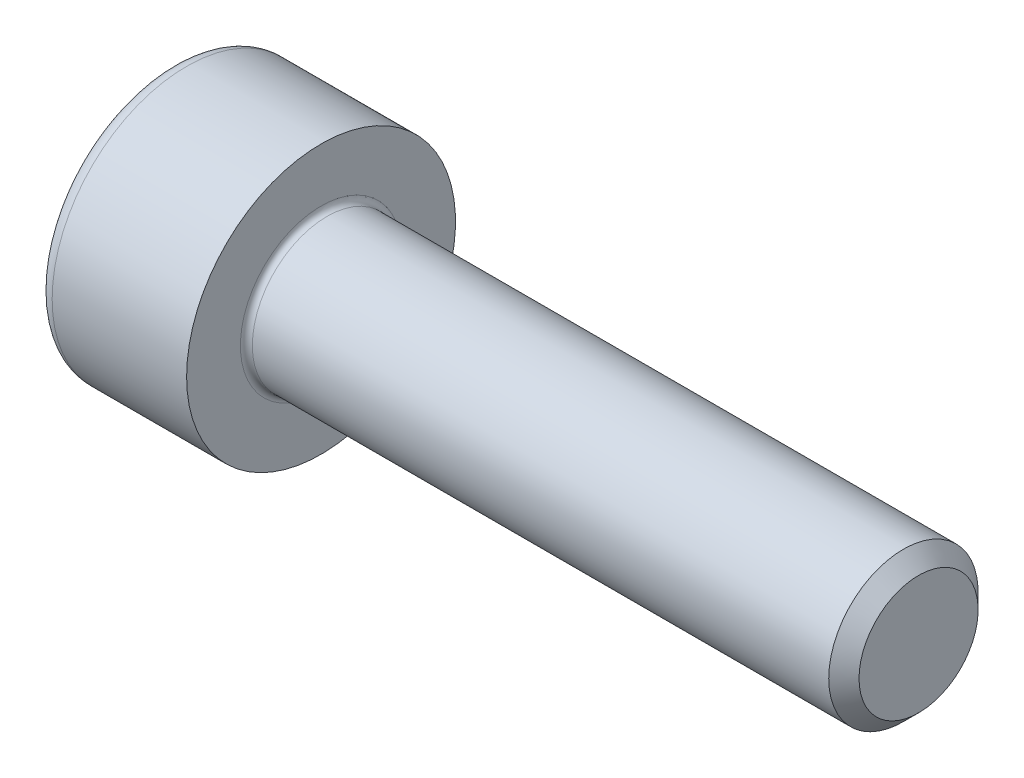
ISO-10303-21;
HEADER;
FILE_DESCRIPTION(('STEP AP214'),'2;1');
FILE_NAME('part.step','',(''),(''),'','','');
FILE_SCHEMA(('AUTOMOTIVE_DESIGN { 1 0 10303 214 1 1 1 1 }'));
ENDSEC;
DATA;
#1=APPLICATION_CONTEXT('core data for automotive mechanical design processes');
#2=APPLICATION_PROTOCOL_DEFINITION('international standard','automotive_design',2000,#1);
#3=PRODUCT_CONTEXT('',#1,'mechanical');
#4=PRODUCT('Part','Part','',(#3));
#5=PRODUCT_RELATED_PRODUCT_CATEGORY('part','',(#4));
#6=PRODUCT_DEFINITION_FORMATION('','',#4);
#7=PRODUCT_DEFINITION_CONTEXT('part definition',#1,'design');
#8=PRODUCT_DEFINITION('design','',#6,#7);
#9=PRODUCT_DEFINITION_SHAPE('','',#8);
#10=(LENGTH_UNIT() NAMED_UNIT(*) SI_UNIT(.MILLI.,.METRE.));
#11=(NAMED_UNIT(*) PLANE_ANGLE_UNIT() SI_UNIT($,.RADIAN.));
#12=(NAMED_UNIT(*) SI_UNIT($,.STERADIAN.) SOLID_ANGLE_UNIT());
#13=UNCERTAINTY_MEASURE_WITH_UNIT(LENGTH_MEASURE(1.E-05),#10,'distance_accuracy_value','');
#14=(GEOMETRIC_REPRESENTATION_CONTEXT(3) GLOBAL_UNCERTAINTY_ASSIGNED_CONTEXT((#13)) GLOBAL_UNIT_ASSIGNED_CONTEXT((#10,
#11,#12)) REPRESENTATION_CONTEXT('',''));
#15=CARTESIAN_POINT('',(0.,0.,0.));
#16=DIRECTION('',(0.,0.,1.));
#17=DIRECTION('',(1.,0.,0.));
#18=AXIS2_PLACEMENT_3D('',#15,#16,#17);
#19=CARTESIAN_POINT('',(0.,0.,0.));
#20=DIRECTION('',(-1.,0.,0.));
#21=DIRECTION('',(0.,0.,1.));
#22=AXIS2_PLACEMENT_3D('',#19,#20,#21);
#23=PLANE('',#22);
#24=DIRECTION('',(0.,-0.499999999999999,0.866025403784439));
#25=VECTOR('',#24,1.);
#26=CARTESIAN_POINT('',(0.,1.16624754376304,0.));
#27=LINE('',#26,#25);
#28=CARTESIAN_POINT('',(0.,1.16624754376304,0.));
#29=VERTEX_POINT('',#28);
#30=CARTESIAN_POINT('',(0.,0.583123771881518,1.01));
#31=VERTEX_POINT('',#30);
#32=EDGE_CURVE('E261',#29,#31,#27,.T.);
#33=ORIENTED_EDGE('',*,*,#32,.T.);
#34=DIRECTION('',(0.,1.,0.));
#35=VECTOR('',#34,1.);
#36=CARTESIAN_POINT('',(0.,-0.583123771881526,1.01));
#37=LINE('',#36,#35);
#38=CARTESIAN_POINT('',(0.,-0.583123771881526,1.01));
#39=VERTEX_POINT('',#38);
#40=EDGE_CURVE('E133',#39,#31,#37,.T.);
#41=ORIENTED_EDGE('',*,*,#40,.F.);
#42=DIRECTION('',(0.,-0.500000000000001,-0.866025403784438));
#43=VECTOR('',#42,1.);
#44=CARTESIAN_POINT('',(0.,-0.583123771881526,1.01));
#45=LINE('',#44,#43);
#46=CARTESIAN_POINT('',(0.,-1.16624754376305,0.));
#47=VERTEX_POINT('',#46);
#48=EDGE_CURVE('E264',#39,#47,#45,.T.);
#49=ORIENTED_EDGE('',*,*,#48,.T.);
#50=DIRECTION('',(0.,0.499999999999999,-0.866025403784439));
#51=VECTOR('',#50,1.);
#52=CARTESIAN_POINT('',(0.,-1.16624754376305,0.));
#53=LINE('',#52,#51);
#54=CARTESIAN_POINT('',(0.,-0.583123771881529,-1.01));
#55=VERTEX_POINT('',#54);
#56=EDGE_CURVE('E267',#47,#55,#53,.T.);
#57=ORIENTED_EDGE('',*,*,#56,.T.);
#58=DIRECTION('',(0.,-1.,0.));
#59=VECTOR('',#58,1.);
#60=CARTESIAN_POINT('',(0.,0.583123771881515,-1.01));
#61=LINE('',#60,#59);
#62=CARTESIAN_POINT('',(0.,0.583123771881515,-1.01));
#63=VERTEX_POINT('',#62);
#64=EDGE_CURVE('E270',#63,#55,#61,.T.);
#65=ORIENTED_EDGE('',*,*,#64,.F.);
#66=DIRECTION('',(0.,-0.500000000000001,-0.866025403784438));
#67=VECTOR('',#66,1.);
#68=CARTESIAN_POINT('',(0.,1.16624754376304,0.));
#69=LINE('',#68,#67);
#70=EDGE_CURVE('E128',#29,#63,#69,.T.);
#71=ORIENTED_EDGE('',*,*,#70,.F.);
#72=EDGE_LOOP('',(#33,#41,#49,#57,#65,#71));
#73=FACE_BOUND('',#72,.T.);
#74=CARTESIAN_POINT('',(0.,0.,0.));
#75=DIRECTION('',(-1.,0.,0.));
#76=DIRECTION('',(0.,0.,1.));
#77=AXIS2_PLACEMENT_3D('',#74,#75,#76);
#78=CIRCLE('',#77,2.);
#79=CARTESIAN_POINT('',(0.,0.,2.));
#80=VERTEX_POINT('',#79);
#81=EDGE_CURVE('E45',#80,#80,#78,.T.);
#82=ORIENTED_EDGE('',*,*,#81,.T.);
#83=EDGE_LOOP('',(#82));
#84=FACE_BOUND('',#83,.T.);
#85=ADVANCED_FACE('F37',(#73,#84),#23,.T.);
#86=CARTESIAN_POINT('',(-31.75,0.,0.));
#87=DIRECTION('',(-1.,0.,0.));
#88=DIRECTION('',(0.,0.,1.));
#89=AXIS2_PLACEMENT_3D('',#86,#87,#88);
#90=CYLINDRICAL_SURFACE('',#89,2.25);
#91=CARTESIAN_POINT('',(0.25,0.,0.));
#92=DIRECTION('',(-1.,0.,0.));
#93=DIRECTION('',(0.,0.,1.));
#94=AXIS2_PLACEMENT_3D('',#91,#92,#93);
#95=CIRCLE('',#94,2.25);
#96=CARTESIAN_POINT('',(0.25,0.,2.25));
#97=VERTEX_POINT('',#96);
#98=EDGE_CURVE('E11',#97,#97,#95,.F.);
#99=ORIENTED_EDGE('',*,*,#98,.T.);
#100=EDGE_LOOP('',(#99));
#101=FACE_BOUND('',#100,.T.);
#102=CARTESIAN_POINT('',(2.5,0.,0.));
#103=DIRECTION('',(-1.,0.,0.));
#104=DIRECTION('',(0.,0.,1.));
#105=AXIS2_PLACEMENT_3D('',#102,#103,#104);
#106=CIRCLE('',#105,2.25);
#107=CARTESIAN_POINT('',(2.5,0.,2.25));
#108=VERTEX_POINT('',#107);
#109=EDGE_CURVE('E151',#108,#108,#106,.T.);
#110=ORIENTED_EDGE('',*,*,#109,.T.);
#111=EDGE_LOOP('',(#110));
#112=FACE_BOUND('',#111,.T.);
#113=ADVANCED_FACE('F175',(#101,#112),#90,.T.);
#114=CARTESIAN_POINT('',(2.5,2.25,0.));
#115=DIRECTION('',(1.,0.,0.));
#116=DIRECTION('',(0.,0.,-1.));
#117=AXIS2_PLACEMENT_3D('',#114,#115,#116);
#118=PLANE('',#117);
#119=CARTESIAN_POINT('',(2.5,0.,0.));
#120=DIRECTION('',(1.,0.,0.));
#121=DIRECTION('',(0.,0.,-1.));
#122=AXIS2_PLACEMENT_3D('',#119,#120,#121);
#123=CIRCLE('',#122,1.35);
#124=CARTESIAN_POINT('',(2.5,0.,-1.35));
#125=VERTEX_POINT('',#124);
#126=EDGE_CURVE('E154',#125,#125,#123,.F.);
#127=ORIENTED_EDGE('',*,*,#126,.T.);
#128=EDGE_LOOP('',(#127));
#129=FACE_BOUND('',#128,.T.);
#130=ORIENTED_EDGE('',*,*,#109,.F.);
#131=EDGE_LOOP('',(#130));
#132=FACE_BOUND('',#131,.T.);
#133=ADVANCED_FACE('F181',(#129,#132),#118,.T.);
#134=CARTESIAN_POINT('',(-31.75,0.,0.));
#135=DIRECTION('',(-1.,0.,0.));
#136=DIRECTION('',(0.,0.,1.));
#137=AXIS2_PLACEMENT_3D('',#134,#135,#136);
#138=CYLINDRICAL_SURFACE('',#137,1.25);
#139=CARTESIAN_POINT('',(2.6,0.,0.));
#140=DIRECTION('',(1.,0.,0.));
#141=DIRECTION('',(0.,0.,-1.));
#142=AXIS2_PLACEMENT_3D('',#139,#140,#141);
#143=CIRCLE('',#142,1.25);
#144=CARTESIAN_POINT('',(2.6,0.,-1.25));
#145=VERTEX_POINT('',#144);
#146=EDGE_CURVE('E157',#145,#145,#143,.T.);
#147=ORIENTED_EDGE('',*,*,#146,.T.);
#148=EDGE_LOOP('',(#147));
#149=FACE_BOUND('',#148,.T.);
#150=CARTESIAN_POINT('',(12.2465,0.,0.));
#151=DIRECTION('',(-1.,0.,0.));
#152=DIRECTION('',(0.,0.,1.));
#153=AXIS2_PLACEMENT_3D('',#150,#151,#152);
#154=CIRCLE('',#153,1.25);
#155=CARTESIAN_POINT('',(12.2465,0.,1.25));
#156=VERTEX_POINT('',#155);
#157=EDGE_CURVE('E148',#156,#156,#154,.T.);
#158=ORIENTED_EDGE('',*,*,#157,.T.);
#159=EDGE_LOOP('',(#158));
#160=FACE_BOUND('',#159,.T.);
#161=ADVANCED_FACE('F187',(#149,#160),#138,.T.);
#162=CARTESIAN_POINT('',(12.5,0.,0.));
#163=DIRECTION('',(-1.,0.,0.));
#164=DIRECTION('',(0.,0.,1.));
#165=AXIS2_PLACEMENT_3D('',#162,#163,#164);
#166=CONICAL_SURFACE('',#165,0.9965,0.785398163397467);
#167=ORIENTED_EDGE('',*,*,#157,.F.);
#168=EDGE_LOOP('',(#167));
#169=FACE_BOUND('',#168,.T.);
#170=CARTESIAN_POINT('',(12.5,0.,0.));
#171=DIRECTION('',(-1.,0.,0.));
#172=DIRECTION('',(0.,0.,1.));
#173=AXIS2_PLACEMENT_3D('',#170,#171,#172);
#174=CIRCLE('',#173,0.9965);
#175=CARTESIAN_POINT('',(12.5,0.,0.9965));
#176=VERTEX_POINT('',#175);
#177=EDGE_CURVE('E144',#176,#176,#174,.T.);
#178=ORIENTED_EDGE('',*,*,#177,.T.);
#179=EDGE_LOOP('',(#178));
#180=FACE_BOUND('',#179,.T.);
#181=ADVANCED_FACE('F191',(#169,#180),#166,.T.);
#182=CARTESIAN_POINT('',(12.5,0.9965,0.));
#183=DIRECTION('',(1.,0.,0.));
#184=DIRECTION('',(0.,0.,-1.));
#185=AXIS2_PLACEMENT_3D('',#182,#183,#184);
#186=PLANE('',#185);
#187=ORIENTED_EDGE('',*,*,#177,.F.);
#188=EDGE_LOOP('',(#187));
#189=FACE_BOUND('',#188,.T.);
#190=ADVANCED_FACE('F171',(#189),#186,.T.);
#191=CARTESIAN_POINT('',(2.6,0.,0.));
#192=DIRECTION('',(1.,0.,0.));
#193=DIRECTION('',(0.,0.,-1.));
#194=AXIS2_PLACEMENT_3D('',#191,#192,#193);
#195=TOROIDAL_SURFACE('',#194,1.35,0.1);
#196=ORIENTED_EDGE('',*,*,#146,.F.);
#197=EDGE_LOOP('',(#196));
#198=FACE_BOUND('',#197,.T.);
#199=ORIENTED_EDGE('',*,*,#126,.F.);
#200=EDGE_LOOP('',(#199));
#201=FACE_BOUND('',#200,.T.);
#202=ADVANCED_FACE('F164',(#198,#201),#195,.F.);
#203=CARTESIAN_POINT('',(0.25,0.,0.));
#204=DIRECTION('',(-1.,0.,0.));
#205=DIRECTION('',(0.,0.,1.));
#206=AXIS2_PLACEMENT_3D('',#203,#204,#205);
#207=TOROIDAL_SURFACE('',#206,2.,0.25);
#208=ORIENTED_EDGE('',*,*,#98,.F.);
#209=EDGE_LOOP('',(#208));
#210=FACE_BOUND('',#209,.T.);
#211=ORIENTED_EDGE('',*,*,#81,.F.);
#212=EDGE_LOOP('',(#211));
#213=FACE_BOUND('',#212,.T.);
#214=ADVANCED_FACE('F39',(#210,#213),#207,.T.);
#215=CARTESIAN_POINT('',(1.1,1.16624754376304,0.));
#216=DIRECTION('',(0.,-0.866025403784439,-0.499999999999999));
#217=DIRECTION('',(0.,0.499999999999999,-0.866025403784439));
#218=AXIS2_PLACEMENT_3D('',#215,#216,#217);
#219=PLANE('',#218);
#220=ORIENTED_EDGE('',*,*,#32,.F.);
#221=DIRECTION('',(-1.,0.,0.));
#222=VECTOR('',#221,1.);
#223=CARTESIAN_POINT('',(1.1,1.16624754376304,0.));
#224=LINE('',#223,#222);
#225=CARTESIAN_POINT('',(1.1,1.16624754376304,0.));
#226=VERTEX_POINT('',#225);
#227=EDGE_CURVE('E251',#226,#29,#224,.T.);
#228=ORIENTED_EDGE('',*,*,#227,.F.);
#229=DIRECTION('',(0.,-0.499999999999999,0.866025403784439));
#230=VECTOR('',#229,1.);
#231=CARTESIAN_POINT('',(1.1,1.16624754376304,0.));
#232=LINE('',#231,#230);
#233=CARTESIAN_POINT('',(1.1,0.874685657822279,0.504999999999996));
#234=VERTEX_POINT('',#233);
#235=EDGE_CURVE('E120',#226,#234,#232,.T.);
#236=ORIENTED_EDGE('',*,*,#235,.T.);
#237=CARTESIAN_POINT('',(1.1,0.583123771881518,1.01));
#238=VERTEX_POINT('',#237);
#239=EDGE_CURVE('E111',#234,#238,#232,.T.);
#240=ORIENTED_EDGE('',*,*,#239,.T.);
#241=DIRECTION('',(-1.,0.,0.));
#242=VECTOR('',#241,1.);
#243=CARTESIAN_POINT('',(1.1,0.583123771881518,1.01));
#244=LINE('',#243,#242);
#245=EDGE_CURVE('E125',#238,#31,#244,.T.);
#246=ORIENTED_EDGE('',*,*,#245,.T.);
#247=EDGE_LOOP('',(#220,#228,#236,#240,#246));
#248=FACE_BOUND('',#247,.T.);
#249=ADVANCED_FACE('F124',(#248),#219,.T.);
#250=CARTESIAN_POINT('',(1.1,-0.583123771881526,1.01));
#251=DIRECTION('',(0.,0.,1.));
#252=DIRECTION('',(0.,-1.,0.));
#253=AXIS2_PLACEMENT_3D('',#250,#251,#252);
#254=PLANE('',#253);
#255=ORIENTED_EDGE('',*,*,#40,.T.);
#256=ORIENTED_EDGE('',*,*,#245,.F.);
#257=DIRECTION('',(0.,1.,0.));
#258=VECTOR('',#257,1.);
#259=CARTESIAN_POINT('',(1.1,-0.583123771881526,1.01));
#260=LINE('',#259,#258);
#261=CARTESIAN_POINT('',(1.1,0.,1.01));
#262=VERTEX_POINT('',#261);
#263=EDGE_CURVE('E108',#262,#238,#260,.T.);
#264=ORIENTED_EDGE('',*,*,#263,.F.);
#265=CARTESIAN_POINT('',(1.1,-0.583123771881526,1.01));
#266=VERTEX_POINT('',#265);
#267=EDGE_CURVE('E119',#266,#262,#260,.T.);
#268=ORIENTED_EDGE('',*,*,#267,.F.);
#269=DIRECTION('',(-1.,0.,0.));
#270=VECTOR('',#269,1.);
#271=CARTESIAN_POINT('',(1.1,-0.583123771881526,1.01));
#272=LINE('',#271,#270);
#273=EDGE_CURVE('E135',#266,#39,#272,.T.);
#274=ORIENTED_EDGE('',*,*,#273,.T.);
#275=EDGE_LOOP('',(#255,#256,#264,#268,#274));
#276=FACE_BOUND('',#275,.T.);
#277=ADVANCED_FACE('F130',(#276),#254,.F.);
#278=CARTESIAN_POINT('',(1.1,-0.583123771881526,1.01));
#279=DIRECTION('',(0.,0.866025403784438,-0.500000000000001));
#280=DIRECTION('',(0.,0.500000000000001,0.866025403784438));
#281=AXIS2_PLACEMENT_3D('',#278,#279,#280);
#282=PLANE('',#281);
#283=ORIENTED_EDGE('',*,*,#48,.F.);
#284=ORIENTED_EDGE('',*,*,#273,.F.);
#285=DIRECTION('',(0.,-0.500000000000001,-0.866025403784438));
#286=VECTOR('',#285,1.);
#287=CARTESIAN_POINT('',(1.1,-0.583123771881526,1.01));
#288=LINE('',#287,#286);
#289=CARTESIAN_POINT('',(1.1,-0.874685657822285,0.505000000000003));
#290=VERTEX_POINT('',#289);
#291=EDGE_CURVE('E290',#266,#290,#288,.T.);
#292=ORIENTED_EDGE('',*,*,#291,.T.);
#293=CARTESIAN_POINT('',(1.1,-1.16624754376305,0.));
#294=VERTEX_POINT('',#293);
#295=EDGE_CURVE('E279',#290,#294,#288,.T.);
#296=ORIENTED_EDGE('',*,*,#295,.T.);
#297=DIRECTION('',(-1.,0.,0.));
#298=VECTOR('',#297,1.);
#299=CARTESIAN_POINT('',(1.1,-1.16624754376305,0.));
#300=LINE('',#299,#298);
#301=EDGE_CURVE('E140',#294,#47,#300,.T.);
#302=ORIENTED_EDGE('',*,*,#301,.T.);
#303=EDGE_LOOP('',(#283,#284,#292,#296,#302));
#304=FACE_BOUND('',#303,.T.);
#305=ADVANCED_FACE('F205',(#304),#282,.T.);
#306=CARTESIAN_POINT('',(1.1,-1.16624754376305,0.));
#307=DIRECTION('',(0.,0.866025403784439,0.499999999999999));
#308=DIRECTION('',(0.,-0.499999999999999,0.86602540378444));
#309=AXIS2_PLACEMENT_3D('',#306,#307,#308);
#310=PLANE('',#309);
#311=ORIENTED_EDGE('',*,*,#56,.F.);
#312=ORIENTED_EDGE('',*,*,#301,.F.);
#313=DIRECTION('',(0.,0.499999999999999,-0.866025403784439));
#314=VECTOR('',#313,1.);
#315=CARTESIAN_POINT('',(1.1,-1.16624754376305,0.));
#316=LINE('',#315,#314);
#317=CARTESIAN_POINT('',(1.1,-0.874685657822289,-0.505000000000001));
#318=VERTEX_POINT('',#317);
#319=EDGE_CURVE('E257',#294,#318,#316,.T.);
#320=ORIENTED_EDGE('',*,*,#319,.T.);
#321=CARTESIAN_POINT('',(1.1,-0.583123771881529,-1.01));
#322=VERTEX_POINT('',#321);
#323=EDGE_CURVE('E289',#318,#322,#316,.T.);
#324=ORIENTED_EDGE('',*,*,#323,.T.);
#325=DIRECTION('',(-1.,0.,0.));
#326=VECTOR('',#325,1.);
#327=CARTESIAN_POINT('',(1.1,-0.583123771881529,-1.01));
#328=LINE('',#327,#326);
#329=EDGE_CURVE('E250',#322,#55,#328,.T.);
#330=ORIENTED_EDGE('',*,*,#329,.T.);
#331=EDGE_LOOP('',(#311,#312,#320,#324,#330));
#332=FACE_BOUND('',#331,.T.);
#333=ADVANCED_FACE('F208',(#332),#310,.T.);
#334=CARTESIAN_POINT('',(1.1,0.583123771881515,-1.01));
#335=DIRECTION('',(0.,0.,-1.));
#336=DIRECTION('',(0.,1.,0.));
#337=AXIS2_PLACEMENT_3D('',#334,#335,#336);
#338=PLANE('',#337);
#339=ORIENTED_EDGE('',*,*,#64,.T.);
#340=ORIENTED_EDGE('',*,*,#329,.F.);
#341=DIRECTION('',(0.,-1.,0.));
#342=VECTOR('',#341,1.);
#343=CARTESIAN_POINT('',(1.1,0.583123771881515,-1.01));
#344=LINE('',#343,#342);
#345=CARTESIAN_POINT('',(1.1,0.,-1.01));
#346=VERTEX_POINT('',#345);
#347=EDGE_CURVE('E254',#346,#322,#344,.T.);
#348=ORIENTED_EDGE('',*,*,#347,.F.);
#349=CARTESIAN_POINT('',(1.1,0.583123771881515,-1.01));
#350=VERTEX_POINT('',#349);
#351=EDGE_CURVE('E52',#350,#346,#344,.T.);
#352=ORIENTED_EDGE('',*,*,#351,.F.);
#353=DIRECTION('',(-1.,0.,0.));
#354=VECTOR('',#353,1.);
#355=CARTESIAN_POINT('',(1.1,0.583123771881515,-1.01));
#356=LINE('',#355,#354);
#357=EDGE_CURVE('E247',#350,#63,#356,.T.);
#358=ORIENTED_EDGE('',*,*,#357,.T.);
#359=EDGE_LOOP('',(#339,#340,#348,#352,#358));
#360=FACE_BOUND('',#359,.T.);
#361=ADVANCED_FACE('F212',(#360),#338,.F.);
#362=CARTESIAN_POINT('',(1.1,1.16624754376304,0.));
#363=DIRECTION('',(0.,0.866025403784438,-0.500000000000001));
#364=DIRECTION('',(0.,0.500000000000001,0.866025403784438));
#365=AXIS2_PLACEMENT_3D('',#362,#363,#364);
#366=PLANE('',#365);
#367=ORIENTED_EDGE('',*,*,#70,.T.);
#368=ORIENTED_EDGE('',*,*,#357,.F.);
#369=DIRECTION('',(0.,-0.500000000000001,-0.866025403784438));
#370=VECTOR('',#369,1.);
#371=CARTESIAN_POINT('',(1.1,1.16624754376304,0.));
#372=LINE('',#371,#370);
#373=CARTESIAN_POINT('',(1.1,0.874685657822279,-0.504999999999999));
#374=VERTEX_POINT('',#373);
#375=EDGE_CURVE('E237',#374,#350,#372,.T.);
#376=ORIENTED_EDGE('',*,*,#375,.F.);
#377=EDGE_CURVE('E243',#226,#374,#372,.T.);
#378=ORIENTED_EDGE('',*,*,#377,.F.);
#379=ORIENTED_EDGE('',*,*,#227,.T.);
#380=EDGE_LOOP('',(#367,#368,#376,#378,#379));
#381=FACE_BOUND('',#380,.T.);
#382=ADVANCED_FACE('F216',(#381),#366,.F.);
#383=CARTESIAN_POINT('',(1.1,1.16624754376304,0.));
#384=DIRECTION('',(1.,0.,0.));
#385=DIRECTION('',(0.,0.,-1.));
#386=AXIS2_PLACEMENT_3D('',#383,#384,#385);
#387=PLANE('',#386);
#388=ORIENTED_EDGE('',*,*,#347,.T.);
#389=ORIENTED_EDGE('',*,*,#323,.F.);
#390=CARTESIAN_POINT('',(1.1,0.,0.));
#391=DIRECTION('',(-1.,0.,0.));
#392=DIRECTION('',(0.,0.,1.));
#393=AXIS2_PLACEMENT_3D('',#390,#391,#392);
#394=CIRCLE('',#393,1.01);
#395=EDGE_CURVE('E285',#346,#318,#394,.T.);
#396=ORIENTED_EDGE('',*,*,#395,.F.);
#397=EDGE_LOOP('',(#388,#389,#396));
#398=FACE_BOUND('',#397,.T.);
#399=ADVANCED_FACE('F220',(#398),#387,.F.);
#400=ORIENTED_EDGE('',*,*,#319,.F.);
#401=ORIENTED_EDGE('',*,*,#295,.F.);
#402=EDGE_CURVE('E138',#318,#290,#394,.T.);
#403=ORIENTED_EDGE('',*,*,#402,.F.);
#404=EDGE_LOOP('',(#400,#401,#403));
#405=FACE_BOUND('',#404,.T.);
#406=ADVANCED_FACE('F223',(#405),#387,.F.);
#407=ORIENTED_EDGE('',*,*,#291,.F.);
#408=ORIENTED_EDGE('',*,*,#267,.T.);
#409=EDGE_CURVE('E134',#290,#262,#394,.T.);
#410=ORIENTED_EDGE('',*,*,#409,.F.);
#411=EDGE_LOOP('',(#407,#408,#410));
#412=FACE_BOUND('',#411,.T.);
#413=ADVANCED_FACE('F228',(#412),#387,.F.);
#414=ORIENTED_EDGE('',*,*,#263,.T.);
#415=ORIENTED_EDGE('',*,*,#239,.F.);
#416=EDGE_CURVE('E114',#262,#234,#394,.T.);
#417=ORIENTED_EDGE('',*,*,#416,.F.);
#418=EDGE_LOOP('',(#414,#415,#417));
#419=FACE_BOUND('',#418,.T.);
#420=ADVANCED_FACE('F110',(#419),#387,.F.);
#421=ORIENTED_EDGE('',*,*,#235,.F.);
#422=ORIENTED_EDGE('',*,*,#377,.T.);
#423=EDGE_CURVE('E145',#234,#374,#394,.T.);
#424=ORIENTED_EDGE('',*,*,#423,.F.);
#425=EDGE_LOOP('',(#421,#422,#424));
#426=FACE_BOUND('',#425,.T.);
#427=ADVANCED_FACE('F231',(#426),#387,.F.);
#428=ORIENTED_EDGE('',*,*,#375,.T.);
#429=ORIENTED_EDGE('',*,*,#351,.T.);
#430=EDGE_CURVE('E240',#374,#346,#394,.T.);
#431=ORIENTED_EDGE('',*,*,#430,.F.);
#432=EDGE_LOOP('',(#428,#429,#431));
#433=FACE_BOUND('',#432,.T.);
#434=ADVANCED_FACE('F201',(#433),#387,.F.);
#435=CARTESIAN_POINT('',(1.1,0.,0.));
#436=DIRECTION('',(-1.,0.,0.));
#437=DIRECTION('',(0.,0.,1.));
#438=AXIS2_PLACEMENT_3D('',#435,#436,#437);
#439=CONICAL_SURFACE('',#438,1.01,1.0471975511966);
#440=CARTESIAN_POINT('',(1.68312377188153,0.,0.));
#441=VERTEX_POINT('',#440);
#442=VERTEX_LOOP('',#441);
#443=FACE_BOUND('',#442,.T.);
#444=ORIENTED_EDGE('',*,*,#416,.T.);
#445=ORIENTED_EDGE('',*,*,#423,.T.);
#446=ORIENTED_EDGE('',*,*,#430,.T.);
#447=ORIENTED_EDGE('',*,*,#395,.T.);
#448=ORIENTED_EDGE('',*,*,#402,.T.);
#449=ORIENTED_EDGE('',*,*,#409,.T.);
#450=EDGE_LOOP('',(#444,#445,#446,#447,#448,#449));
#451=FACE_BOUND('',#450,.T.);
#452=ADVANCED_FACE('F199',(#443,#451),#439,.F.);
#453=CLOSED_SHELL('',(#85,#113,#133,#161,#181,#190,#202,#214,#249,#277,#305,#333,#361,#382,#399,
#406,#413,#420,#427,#434,#452));
#454=MANIFOLD_SOLID_BREP('B2',#453);
#455=ADVANCED_BREP_SHAPE_REPRESENTATION('',(#18,#454),#14);
#456=SHAPE_DEFINITION_REPRESENTATION(#9,#455);
ENDSEC;
END-ISO-10303-21;
